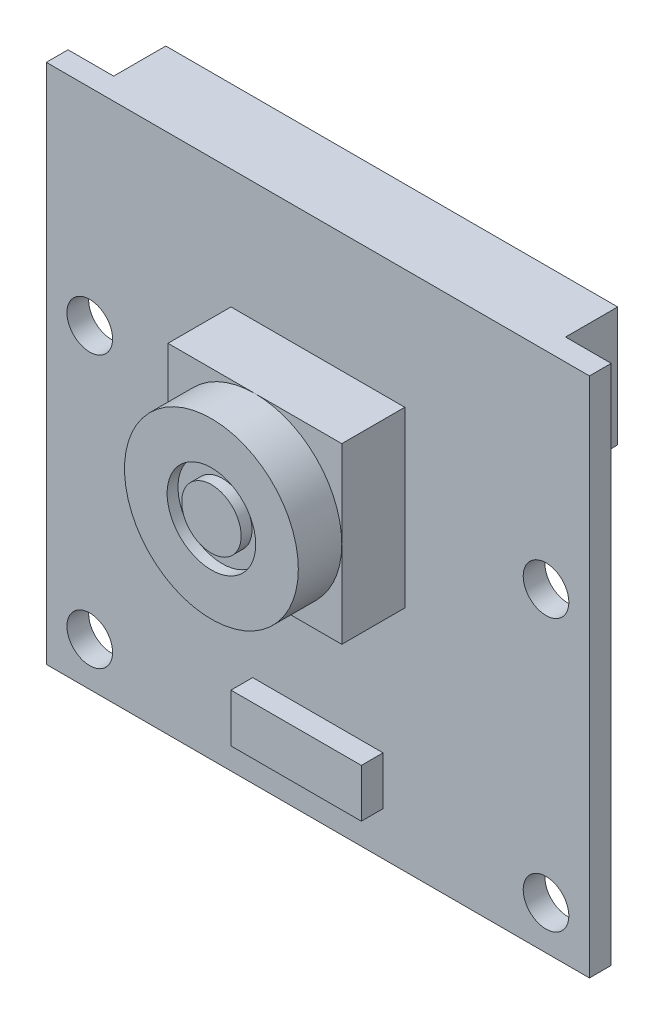
ISO-10303-21;
HEADER;
FILE_DESCRIPTION(('STEP AP214'),'2;1');
FILE_NAME('part.step','',(''),(''),'','','');
FILE_SCHEMA(('AUTOMOTIVE_DESIGN { 1 0 10303 214 1 1 1 1 }'));
ENDSEC;
DATA;
#1=APPLICATION_CONTEXT('core data for automotive mechanical design processes');
#2=APPLICATION_PROTOCOL_DEFINITION('international standard','automotive_design',2000,#1);
#3=PRODUCT_CONTEXT('',#1,'mechanical');
#4=PRODUCT('Part','Part','',(#3));
#5=PRODUCT_RELATED_PRODUCT_CATEGORY('part','',(#4));
#6=PRODUCT_DEFINITION_FORMATION('','',#4);
#7=PRODUCT_DEFINITION_CONTEXT('part definition',#1,'design');
#8=PRODUCT_DEFINITION('design','',#6,#7);
#9=PRODUCT_DEFINITION_SHAPE('','',#8);
#10=(LENGTH_UNIT() NAMED_UNIT(*) SI_UNIT(.MILLI.,.METRE.));
#11=(NAMED_UNIT(*) PLANE_ANGLE_UNIT() SI_UNIT($,.RADIAN.));
#12=(NAMED_UNIT(*) SI_UNIT($,.STERADIAN.) SOLID_ANGLE_UNIT());
#13=UNCERTAINTY_MEASURE_WITH_UNIT(LENGTH_MEASURE(1.E-05),#10,'distance_accuracy_value','');
#14=(GEOMETRIC_REPRESENTATION_CONTEXT(3) GLOBAL_UNCERTAINTY_ASSIGNED_CONTEXT((#13)) GLOBAL_UNIT_ASSIGNED_CONTEXT((#10,
#11,#12)) REPRESENTATION_CONTEXT('',''));
#15=CARTESIAN_POINT('',(0.,0.,0.));
#16=DIRECTION('',(0.,0.,1.));
#17=DIRECTION('',(1.,0.,0.));
#18=AXIS2_PLACEMENT_3D('',#15,#16,#17);
#19=CARTESIAN_POINT('',(0.,0.,1.));
#20=DIRECTION('',(0.,0.,1.));
#21=DIRECTION('',(1.,0.,0.));
#22=AXIS2_PLACEMENT_3D('',#19,#20,#21);
#23=PLANE('',#22);
#24=CARTESIAN_POINT('',(10.5,-10.,1.));
#25=DIRECTION('',(0.,0.,1.));
#26=DIRECTION('',(-1.,0.,0.));
#27=AXIS2_PLACEMENT_3D('',#24,#25,#26);
#28=CIRCLE('',#27,1.05);
#29=CARTESIAN_POINT('',(9.45,-10.,1.));
#30=VERTEX_POINT('',#29);
#31=EDGE_CURVE('E326',#30,#30,#28,.T.);
#32=ORIENTED_EDGE('',*,*,#31,.F.);
#33=EDGE_LOOP('',(#32));
#34=FACE_BOUND('',#33,.T.);
#35=CARTESIAN_POINT('',(-10.5,2.5,1.));
#36=DIRECTION('',(0.,0.,1.));
#37=DIRECTION('',(1.,0.,0.));
#38=AXIS2_PLACEMENT_3D('',#35,#36,#37);
#39=CIRCLE('',#38,1.05);
#40=CARTESIAN_POINT('',(-9.45,2.5,1.));
#41=VERTEX_POINT('',#40);
#42=EDGE_CURVE('E338',#41,#41,#39,.T.);
#43=ORIENTED_EDGE('',*,*,#42,.F.);
#44=EDGE_LOOP('',(#43));
#45=FACE_BOUND('',#44,.T.);
#46=DIRECTION('',(0.,1.,0.));
#47=VECTOR('',#46,1.);
#48=CARTESIAN_POINT('',(12.5,12.,1.));
#49=LINE('',#48,#47);
#50=CARTESIAN_POINT('',(12.5,-12.,1.));
#51=VERTEX_POINT('',#50);
#52=CARTESIAN_POINT('',(12.5,12.,1.));
#53=VERTEX_POINT('',#52);
#54=EDGE_CURVE('E344',#51,#53,#49,.T.);
#55=ORIENTED_EDGE('',*,*,#54,.T.);
#56=DIRECTION('',(-1.,0.,0.));
#57=VECTOR('',#56,1.);
#58=CARTESIAN_POINT('',(-12.5,12.,1.));
#59=LINE('',#58,#57);
#60=CARTESIAN_POINT('',(-12.5,12.,1.));
#61=VERTEX_POINT('',#60);
#62=EDGE_CURVE('E347',#53,#61,#59,.T.);
#63=ORIENTED_EDGE('',*,*,#62,.T.);
#64=DIRECTION('',(0.,-1.,0.));
#65=VECTOR('',#64,1.);
#66=CARTESIAN_POINT('',(-12.5,12.,1.));
#67=LINE('',#66,#65);
#68=CARTESIAN_POINT('',(-12.5,-12.,1.));
#69=VERTEX_POINT('',#68);
#70=EDGE_CURVE('E350',#61,#69,#67,.T.);
#71=ORIENTED_EDGE('',*,*,#70,.T.);
#72=DIRECTION('',(1.,0.,0.));
#73=VECTOR('',#72,1.);
#74=CARTESIAN_POINT('',(-12.5,-12.,1.));
#75=LINE('',#74,#73);
#76=EDGE_CURVE('E352',#69,#51,#75,.T.);
#77=ORIENTED_EDGE('',*,*,#76,.T.);
#78=EDGE_LOOP('',(#55,#63,#71,#77));
#79=FACE_BOUND('',#78,.T.);
#80=CARTESIAN_POINT('',(-10.5,-10.,1.));
#81=DIRECTION('',(0.,0.,1.));
#82=DIRECTION('',(1.,0.,0.));
#83=AXIS2_PLACEMENT_3D('',#80,#81,#82);
#84=CIRCLE('',#83,1.05);
#85=CARTESIAN_POINT('',(-9.45,-10.,1.));
#86=VERTEX_POINT('',#85);
#87=EDGE_CURVE('E332',#86,#86,#84,.T.);
#88=ORIENTED_EDGE('',*,*,#87,.F.);
#89=EDGE_LOOP('',(#88));
#90=FACE_BOUND('',#89,.T.);
#91=CARTESIAN_POINT('',(10.5,2.5,1.));
#92=DIRECTION('',(0.,0.,1.));
#93=DIRECTION('',(-1.,0.,0.));
#94=AXIS2_PLACEMENT_3D('',#91,#92,#93);
#95=CIRCLE('',#94,1.05);
#96=CARTESIAN_POINT('',(9.45,2.5,1.));
#97=VERTEX_POINT('',#96);
#98=EDGE_CURVE('E320',#97,#97,#95,.T.);
#99=ORIENTED_EDGE('',*,*,#98,.F.);
#100=EDGE_LOOP('',(#99));
#101=FACE_BOUND('',#100,.T.);
#102=DIRECTION('',(1.,0.,0.));
#103=VECTOR('',#102,1.);
#104=CARTESIAN_POINT('',(-3.99999999999999,-1.5,1.));
#105=LINE('',#104,#103);
#106=CARTESIAN_POINT('',(-3.99999999999999,-1.5,1.));
#107=VERTEX_POINT('',#106);
#108=CARTESIAN_POINT('',(4.00000000000001,-1.5,1.));
#109=VERTEX_POINT('',#108);
#110=EDGE_CURVE('E275',#107,#109,#105,.T.);
#111=ORIENTED_EDGE('',*,*,#110,.F.);
#112=DIRECTION('',(0.,-1.,0.));
#113=VECTOR('',#112,1.);
#114=CARTESIAN_POINT('',(-3.99999999999999,-1.5,1.));
#115=LINE('',#114,#113);
#116=CARTESIAN_POINT('',(-3.99999999999999,6.5,1.));
#117=VERTEX_POINT('',#116);
#118=EDGE_CURVE('E270',#117,#107,#115,.T.);
#119=ORIENTED_EDGE('',*,*,#118,.F.);
#120=DIRECTION('',(-1.,0.,0.));
#121=VECTOR('',#120,1.);
#122=CARTESIAN_POINT('',(-3.99999999999999,6.5,1.));
#123=LINE('',#122,#121);
#124=CARTESIAN_POINT('',(4.00000000000001,6.5,1.));
#125=VERTEX_POINT('',#124);
#126=EDGE_CURVE('E280',#125,#117,#123,.T.);
#127=ORIENTED_EDGE('',*,*,#126,.F.);
#128=DIRECTION('',(0.,1.,0.));
#129=VECTOR('',#128,1.);
#130=CARTESIAN_POINT('',(4.00000000000001,-1.5,1.));
#131=LINE('',#130,#129);
#132=EDGE_CURVE('E278',#109,#125,#131,.T.);
#133=ORIENTED_EDGE('',*,*,#132,.F.);
#134=EDGE_LOOP('',(#111,#119,#127,#133));
#135=FACE_BOUND('',#134,.T.);
#136=DIRECTION('',(1.,0.,0.));
#137=VECTOR('',#136,1.);
#138=CARTESIAN_POINT('',(-2.99999999999999,-10.,1.));
#139=LINE('',#138,#137);
#140=CARTESIAN_POINT('',(-2.99999999999999,-10.,1.));
#141=VERTEX_POINT('',#140);
#142=CARTESIAN_POINT('',(3.00000000000001,-10.,1.));
#143=VERTEX_POINT('',#142);
#144=EDGE_CURVE('E621',#141,#143,#139,.T.);
#145=ORIENTED_EDGE('',*,*,#144,.F.);
#146=DIRECTION('',(0.,-1.,0.));
#147=VECTOR('',#146,1.);
#148=CARTESIAN_POINT('',(-2.99999999999999,-10.,1.));
#149=LINE('',#148,#147);
#150=CARTESIAN_POINT('',(-2.99999999999999,-7.77539273210694,1.));
#151=VERTEX_POINT('',#150);
#152=EDGE_CURVE('E222',#151,#141,#149,.T.);
#153=ORIENTED_EDGE('',*,*,#152,.F.);
#154=DIRECTION('',(-1.,0.,0.));
#155=VECTOR('',#154,1.);
#156=CARTESIAN_POINT('',(-2.99999999999999,-7.77539273210694,1.));
#157=LINE('',#156,#155);
#158=CARTESIAN_POINT('',(3.00000000000001,-7.77539273210694,1.));
#159=VERTEX_POINT('',#158);
#160=EDGE_CURVE('E218',#159,#151,#157,.T.);
#161=ORIENTED_EDGE('',*,*,#160,.F.);
#162=DIRECTION('',(0.,1.,0.));
#163=VECTOR('',#162,1.);
#164=CARTESIAN_POINT('',(3.00000000000001,-10.,1.));
#165=LINE('',#164,#163);
#166=EDGE_CURVE('E623',#143,#159,#165,.T.);
#167=ORIENTED_EDGE('',*,*,#166,.F.);
#168=EDGE_LOOP('',(#145,#153,#161,#167));
#169=FACE_BOUND('',#168,.T.);
#170=ADVANCED_FACE('F72',(#34,#45,#79,#90,#101,#135,#169),#23,.T.);
#171=CARTESIAN_POINT('',(0.,0.,5.9));
#172=DIRECTION('',(0.,0.,-1.));
#173=DIRECTION('',(-1.,0.,0.));
#174=AXIS2_PLACEMENT_3D('',#171,#172,#173);
#175=PLANE('',#174);
#176=CARTESIAN_POINT('',(0.,2.5,5.9));
#177=DIRECTION('',(0.,0.,1.));
#178=DIRECTION('',(1.,0.,0.));
#179=AXIS2_PLACEMENT_3D('',#176,#177,#178);
#180=CIRCLE('',#179,2.03819798857282);
#181=CARTESIAN_POINT('',(2.03819798857282,2.5,5.9));
#182=VERTEX_POINT('',#181);
#183=EDGE_CURVE('E233',#182,#182,#180,.T.);
#184=ORIENTED_EDGE('',*,*,#183,.F.);
#185=EDGE_LOOP('',(#184));
#186=FACE_BOUND('',#185,.T.);
#187=CARTESIAN_POINT('',(0.,2.5,5.9));
#188=DIRECTION('',(0.,0.,1.));
#189=DIRECTION('',(1.,0.,0.));
#190=AXIS2_PLACEMENT_3D('',#187,#188,#189);
#191=CIRCLE('',#190,4.);
#192=CARTESIAN_POINT('',(4.,2.5,5.9));
#193=VERTEX_POINT('',#192);
#194=EDGE_CURVE('E261',#193,#193,#191,.T.);
#195=ORIENTED_EDGE('',*,*,#194,.T.);
#196=EDGE_LOOP('',(#195));
#197=FACE_BOUND('',#196,.T.);
#198=ADVANCED_FACE('F415',(#186,#197),#175,.F.);
#199=CARTESIAN_POINT('',(-3.99999999999999,-1.5,5.9));
#200=DIRECTION('',(1.,0.,0.));
#201=DIRECTION('',(0.,0.,-1.));
#202=AXIS2_PLACEMENT_3D('',#199,#200,#201);
#203=PLANE('',#202);
#204=DIRECTION('',(0.,-1.,0.));
#205=VECTOR('',#204,1.);
#206=CARTESIAN_POINT('',(-3.99999999999999,0.,3.9));
#207=LINE('',#206,#205);
#208=CARTESIAN_POINT('',(-3.99999999999999,2.5,3.9));
#209=VERTEX_POINT('',#208);
#210=CARTESIAN_POINT('',(-3.99999999999999,-1.5,3.9));
#211=VERTEX_POINT('',#210);
#212=EDGE_CURVE('E243',#209,#211,#207,.T.);
#213=ORIENTED_EDGE('',*,*,#212,.F.);
#214=DIRECTION('',(0.,-1.,0.));
#215=VECTOR('',#214,1.);
#216=CARTESIAN_POINT('',(-3.99999999999999,0.,3.9));
#217=LINE('',#216,#215);
#218=CARTESIAN_POINT('',(-3.99999999999999,6.5,3.9));
#219=VERTEX_POINT('',#218);
#220=EDGE_CURVE('E267',#219,#209,#217,.T.);
#221=ORIENTED_EDGE('',*,*,#220,.F.);
#222=DIRECTION('',(0.,0.,-1.));
#223=VECTOR('',#222,1.);
#224=CARTESIAN_POINT('',(-3.99999999999999,6.5,5.9));
#225=LINE('',#224,#223);
#226=EDGE_CURVE('E282',#219,#117,#225,.T.);
#227=ORIENTED_EDGE('',*,*,#226,.T.);
#228=ORIENTED_EDGE('',*,*,#118,.T.);
#229=DIRECTION('',(0.,0.,-1.));
#230=VECTOR('',#229,1.);
#231=CARTESIAN_POINT('',(-3.99999999999999,-1.5,5.9));
#232=LINE('',#231,#230);
#233=EDGE_CURVE('E287',#211,#107,#232,.T.);
#234=ORIENTED_EDGE('',*,*,#233,.F.);
#235=EDGE_LOOP('',(#213,#221,#227,#228,#234));
#236=FACE_BOUND('',#235,.T.);
#237=ADVANCED_FACE('F421',(#236),#203,.F.);
#238=CARTESIAN_POINT('',(-3.99999999999999,-1.5,5.9));
#239=DIRECTION('',(0.,1.,0.));
#240=DIRECTION('',(0.,0.,1.));
#241=AXIS2_PLACEMENT_3D('',#238,#239,#240);
#242=PLANE('',#241);
#243=DIRECTION('',(1.,0.,0.));
#244=VECTOR('',#243,1.);
#245=CARTESIAN_POINT('',(0.,-1.5,3.9));
#246=LINE('',#245,#244);
#247=CARTESIAN_POINT('',(0.,-1.5,3.9));
#248=VERTEX_POINT('',#247);
#249=EDGE_CURVE('E238',#211,#248,#246,.T.);
#250=ORIENTED_EDGE('',*,*,#249,.F.);
#251=ORIENTED_EDGE('',*,*,#233,.T.);
#252=ORIENTED_EDGE('',*,*,#110,.T.);
#253=DIRECTION('',(0.,0.,-1.));
#254=VECTOR('',#253,1.);
#255=CARTESIAN_POINT('',(4.00000000000001,-1.5,5.9));
#256=LINE('',#255,#254);
#257=CARTESIAN_POINT('',(4.00000000000001,-1.5,3.9));
#258=VERTEX_POINT('',#257);
#259=EDGE_CURVE('E285',#258,#109,#256,.T.);
#260=ORIENTED_EDGE('',*,*,#259,.F.);
#261=DIRECTION('',(1.,0.,0.));
#262=VECTOR('',#261,1.);
#263=CARTESIAN_POINT('',(0.,-1.5,3.9));
#264=LINE('',#263,#262);
#265=EDGE_CURVE('E250',#248,#258,#264,.T.);
#266=ORIENTED_EDGE('',*,*,#265,.F.);
#267=EDGE_LOOP('',(#250,#251,#252,#260,#266));
#268=FACE_BOUND('',#267,.T.);
#269=ADVANCED_FACE('F464',(#268),#242,.F.);
#270=CARTESIAN_POINT('',(4.00000000000001,-1.5,5.9));
#271=DIRECTION('',(-1.,0.,0.));
#272=DIRECTION('',(0.,0.,1.));
#273=AXIS2_PLACEMENT_3D('',#270,#271,#272);
#274=PLANE('',#273);
#275=DIRECTION('',(0.,1.,0.));
#276=VECTOR('',#275,1.);
#277=CARTESIAN_POINT('',(4.00000000000001,0.,3.9));
#278=LINE('',#277,#276);
#279=CARTESIAN_POINT('',(4.00000000000001,2.5,3.9));
#280=VERTEX_POINT('',#279);
#281=EDGE_CURVE('E252',#258,#280,#278,.T.);
#282=ORIENTED_EDGE('',*,*,#281,.F.);
#283=ORIENTED_EDGE('',*,*,#259,.T.);
#284=ORIENTED_EDGE('',*,*,#132,.T.);
#285=DIRECTION('',(0.,0.,-1.));
#286=VECTOR('',#285,1.);
#287=CARTESIAN_POINT('',(4.00000000000001,6.5,5.9));
#288=LINE('',#287,#286);
#289=CARTESIAN_POINT('',(4.00000000000001,6.5,3.9));
#290=VERTEX_POINT('',#289);
#291=EDGE_CURVE('E95',#290,#125,#288,.T.);
#292=ORIENTED_EDGE('',*,*,#291,.F.);
#293=DIRECTION('',(0.,1.,0.));
#294=VECTOR('',#293,1.);
#295=CARTESIAN_POINT('',(4.00000000000001,0.,3.9));
#296=LINE('',#295,#294);
#297=EDGE_CURVE('E256',#280,#290,#296,.T.);
#298=ORIENTED_EDGE('',*,*,#297,.F.);
#299=EDGE_LOOP('',(#282,#283,#284,#292,#298));
#300=FACE_BOUND('',#299,.T.);
#301=ADVANCED_FACE('F456',(#300),#274,.F.);
#302=CARTESIAN_POINT('',(-3.99999999999999,6.5,5.9));
#303=DIRECTION('',(0.,-1.,0.));
#304=DIRECTION('',(0.,0.,-1.));
#305=AXIS2_PLACEMENT_3D('',#302,#303,#304);
#306=PLANE('',#305);
#307=DIRECTION('',(-1.,0.,0.));
#308=VECTOR('',#307,1.);
#309=CARTESIAN_POINT('',(0.,6.5,3.9));
#310=LINE('',#309,#308);
#311=CARTESIAN_POINT('',(0.,6.5,3.9));
#312=VERTEX_POINT('',#311);
#313=EDGE_CURVE('E254',#290,#312,#310,.T.);
#314=ORIENTED_EDGE('',*,*,#313,.F.);
#315=ORIENTED_EDGE('',*,*,#291,.T.);
#316=ORIENTED_EDGE('',*,*,#126,.T.);
#317=ORIENTED_EDGE('',*,*,#226,.F.);
#318=DIRECTION('',(-1.,0.,0.));
#319=VECTOR('',#318,1.);
#320=CARTESIAN_POINT('',(0.,6.5,3.9));
#321=LINE('',#320,#319);
#322=EDGE_CURVE('E265',#312,#219,#321,.T.);
#323=ORIENTED_EDGE('',*,*,#322,.F.);
#324=EDGE_LOOP('',(#314,#315,#316,#317,#323));
#325=FACE_BOUND('',#324,.T.);
#326=ADVANCED_FACE('F433',(#325),#306,.F.);
#327=CARTESIAN_POINT('',(0.,0.,0.));
#328=DIRECTION('',(0.,0.,1.));
#329=DIRECTION('',(1.,0.,0.));
#330=AXIS2_PLACEMENT_3D('',#327,#328,#329);
#331=PLANE('',#330);
#332=CARTESIAN_POINT('',(10.5,2.5,0.));
#333=DIRECTION('',(0.,0.,1.));
#334=DIRECTION('',(-1.,0.,0.));
#335=AXIS2_PLACEMENT_3D('',#332,#333,#334);
#336=CIRCLE('',#335,1.05);
#337=CARTESIAN_POINT('',(9.45,2.5,0.));
#338=VERTEX_POINT('',#337);
#339=EDGE_CURVE('E319',#338,#338,#336,.T.);
#340=ORIENTED_EDGE('',*,*,#339,.T.);
#341=EDGE_LOOP('',(#340));
#342=FACE_BOUND('',#341,.T.);
#343=CARTESIAN_POINT('',(10.5,-10.,0.));
#344=DIRECTION('',(0.,0.,1.));
#345=DIRECTION('',(-1.,0.,0.));
#346=AXIS2_PLACEMENT_3D('',#343,#344,#345);
#347=CIRCLE('',#346,1.05);
#348=CARTESIAN_POINT('',(9.45,-10.,0.));
#349=VERTEX_POINT('',#348);
#350=EDGE_CURVE('E323',#349,#349,#347,.T.);
#351=ORIENTED_EDGE('',*,*,#350,.T.);
#352=EDGE_LOOP('',(#351));
#353=FACE_BOUND('',#352,.T.);
#354=CARTESIAN_POINT('',(-10.5,-10.,0.));
#355=DIRECTION('',(0.,0.,1.));
#356=DIRECTION('',(1.,0.,0.));
#357=AXIS2_PLACEMENT_3D('',#354,#355,#356);
#358=CIRCLE('',#357,1.05);
#359=CARTESIAN_POINT('',(-9.45,-10.,0.));
#360=VERTEX_POINT('',#359);
#361=EDGE_CURVE('E329',#360,#360,#358,.T.);
#362=ORIENTED_EDGE('',*,*,#361,.T.);
#363=EDGE_LOOP('',(#362));
#364=FACE_BOUND('',#363,.T.);
#365=CARTESIAN_POINT('',(-10.5,2.5,0.));
#366=DIRECTION('',(0.,0.,1.));
#367=DIRECTION('',(1.,0.,0.));
#368=AXIS2_PLACEMENT_3D('',#365,#366,#367);
#369=CIRCLE('',#368,1.05);
#370=CARTESIAN_POINT('',(-9.45,2.5,0.));
#371=VERTEX_POINT('',#370);
#372=EDGE_CURVE('E335',#371,#371,#369,.T.);
#373=ORIENTED_EDGE('',*,*,#372,.T.);
#374=EDGE_LOOP('',(#373));
#375=FACE_BOUND('',#374,.T.);
#376=DIRECTION('',(0.,1.,0.));
#377=VECTOR('',#376,1.);
#378=CARTESIAN_POINT('',(-10.4,12.,0.));
#379=LINE('',#378,#377);
#380=CARTESIAN_POINT('',(-10.4,6.5,0.));
#381=VERTEX_POINT('',#380);
#382=CARTESIAN_POINT('',(-10.4,12.,0.));
#383=VERTEX_POINT('',#382);
#384=EDGE_CURVE('E289',#381,#383,#379,.T.);
#385=ORIENTED_EDGE('',*,*,#384,.F.);
#386=DIRECTION('',(-1.,0.,0.));
#387=VECTOR('',#386,1.);
#388=CARTESIAN_POINT('',(-10.4,6.5,0.));
#389=LINE('',#388,#387);
#390=CARTESIAN_POINT('',(10.4,6.5,0.));
#391=VERTEX_POINT('',#390);
#392=EDGE_CURVE('E294',#391,#381,#389,.T.);
#393=ORIENTED_EDGE('',*,*,#392,.F.);
#394=DIRECTION('',(0.,-1.,0.));
#395=VECTOR('',#394,1.);
#396=CARTESIAN_POINT('',(10.4,12.,0.));
#397=LINE('',#396,#395);
#398=CARTESIAN_POINT('',(10.4,12.,0.));
#399=VERTEX_POINT('',#398);
#400=EDGE_CURVE('E303',#399,#391,#397,.T.);
#401=ORIENTED_EDGE('',*,*,#400,.F.);
#402=DIRECTION('',(-1.,0.,0.));
#403=VECTOR('',#402,1.);
#404=CARTESIAN_POINT('',(-12.5,12.,0.));
#405=LINE('',#404,#403);
#406=CARTESIAN_POINT('',(12.5,12.,0.));
#407=VERTEX_POINT('',#406);
#408=EDGE_CURVE('E358',#407,#399,#405,.T.);
#409=ORIENTED_EDGE('',*,*,#408,.F.);
#410=DIRECTION('',(0.,1.,0.));
#411=VECTOR('',#410,1.);
#412=CARTESIAN_POINT('',(12.5,12.,0.));
#413=LINE('',#412,#411);
#414=CARTESIAN_POINT('',(12.5,-12.,0.));
#415=VERTEX_POINT('',#414);
#416=EDGE_CURVE('E341',#415,#407,#413,.T.);
#417=ORIENTED_EDGE('',*,*,#416,.F.);
#418=DIRECTION('',(1.,0.,0.));
#419=VECTOR('',#418,1.);
#420=CARTESIAN_POINT('',(-12.5,-12.,0.));
#421=LINE('',#420,#419);
#422=CARTESIAN_POINT('',(-12.5,-12.,0.));
#423=VERTEX_POINT('',#422);
#424=EDGE_CURVE('E348',#423,#415,#421,.T.);
#425=ORIENTED_EDGE('',*,*,#424,.F.);
#426=DIRECTION('',(0.,-1.,0.));
#427=VECTOR('',#426,1.);
#428=CARTESIAN_POINT('',(-12.5,12.,0.));
#429=LINE('',#428,#427);
#430=CARTESIAN_POINT('',(-12.5,12.,0.));
#431=VERTEX_POINT('',#430);
#432=EDGE_CURVE('E361',#431,#423,#429,.T.);
#433=ORIENTED_EDGE('',*,*,#432,.F.);
#434=EDGE_CURVE('E357',#383,#431,#405,.T.);
#435=ORIENTED_EDGE('',*,*,#434,.F.);
#436=EDGE_LOOP('',(#385,#393,#401,#409,#417,#425,#433,#435));
#437=FACE_BOUND('',#436,.T.);
#438=ADVANCED_FACE('F378',(#342,#353,#364,#375,#437),#331,.F.);
#439=CARTESIAN_POINT('',(12.5,12.,1.));
#440=DIRECTION('',(-1.,0.,0.));
#441=DIRECTION('',(0.,-1.,0.));
#442=AXIS2_PLACEMENT_3D('',#439,#440,#441);
#443=PLANE('',#442);
#444=ORIENTED_EDGE('',*,*,#416,.T.);
#445=DIRECTION('',(0.,0.,-1.));
#446=VECTOR('',#445,1.);
#447=CARTESIAN_POINT('',(12.5,12.,1.));
#448=LINE('',#447,#446);
#449=EDGE_CURVE('E12',#53,#407,#448,.T.);
#450=ORIENTED_EDGE('',*,*,#449,.F.);
#451=ORIENTED_EDGE('',*,*,#54,.F.);
#452=DIRECTION('',(0.,0.,-1.));
#453=VECTOR('',#452,1.);
#454=CARTESIAN_POINT('',(12.5,-12.,1.));
#455=LINE('',#454,#453);
#456=EDGE_CURVE('E354',#51,#415,#455,.T.);
#457=ORIENTED_EDGE('',*,*,#456,.T.);
#458=EDGE_LOOP('',(#444,#450,#451,#457));
#459=FACE_BOUND('',#458,.T.);
#460=ADVANCED_FACE('F74',(#459),#443,.F.);
#461=CARTESIAN_POINT('',(-12.5,12.,1.));
#462=DIRECTION('',(0.,-1.,0.));
#463=DIRECTION('',(0.,0.,-1.));
#464=AXIS2_PLACEMENT_3D('',#461,#462,#463);
#465=PLANE('',#464);
#466=ORIENTED_EDGE('',*,*,#408,.T.);
#467=DIRECTION('',(0.,0.,1.));
#468=VECTOR('',#467,1.);
#469=CARTESIAN_POINT('',(10.4,12.,-2.4));
#470=LINE('',#469,#468);
#471=CARTESIAN_POINT('',(10.4,12.,-2.4));
#472=VERTEX_POINT('',#471);
#473=EDGE_CURVE('E313',#472,#399,#470,.T.);
#474=ORIENTED_EDGE('',*,*,#473,.F.);
#475=DIRECTION('',(1.,0.,0.));
#476=VECTOR('',#475,1.);
#477=CARTESIAN_POINT('',(-10.4,12.,-2.4));
#478=LINE('',#477,#476);
#479=CARTESIAN_POINT('',(-10.4,12.,-2.4));
#480=VERTEX_POINT('',#479);
#481=EDGE_CURVE('E293',#480,#472,#478,.T.);
#482=ORIENTED_EDGE('',*,*,#481,.F.);
#483=DIRECTION('',(0.,0.,1.));
#484=VECTOR('',#483,1.);
#485=CARTESIAN_POINT('',(-10.4,12.,-2.4));
#486=LINE('',#485,#484);
#487=EDGE_CURVE('E316',#480,#383,#486,.T.);
#488=ORIENTED_EDGE('',*,*,#487,.T.);
#489=ORIENTED_EDGE('',*,*,#434,.T.);
#490=DIRECTION('',(0.,0.,-1.));
#491=VECTOR('',#490,1.);
#492=CARTESIAN_POINT('',(-12.5,12.,1.));
#493=LINE('',#492,#491);
#494=EDGE_CURVE('E80',#61,#431,#493,.T.);
#495=ORIENTED_EDGE('',*,*,#494,.F.);
#496=ORIENTED_EDGE('',*,*,#62,.F.);
#497=ORIENTED_EDGE('',*,*,#449,.T.);
#498=EDGE_LOOP('',(#466,#474,#482,#488,#489,#495,#496,#497));
#499=FACE_BOUND('',#498,.T.);
#500=ADVANCED_FACE('F389',(#499),#465,.F.);
#501=CARTESIAN_POINT('',(-12.5,12.,1.));
#502=DIRECTION('',(1.,0.,0.));
#503=DIRECTION('',(0.,1.,0.));
#504=AXIS2_PLACEMENT_3D('',#501,#502,#503);
#505=PLANE('',#504);
#506=ORIENTED_EDGE('',*,*,#432,.T.);
#507=DIRECTION('',(0.,0.,-1.));
#508=VECTOR('',#507,1.);
#509=CARTESIAN_POINT('',(-12.5,-12.,1.));
#510=LINE('',#509,#508);
#511=EDGE_CURVE('E366',#69,#423,#510,.T.);
#512=ORIENTED_EDGE('',*,*,#511,.F.);
#513=ORIENTED_EDGE('',*,*,#70,.F.);
#514=ORIENTED_EDGE('',*,*,#494,.T.);
#515=EDGE_LOOP('',(#506,#512,#513,#514));
#516=FACE_BOUND('',#515,.T.);
#517=ADVANCED_FACE('F373',(#516),#505,.F.);
#518=CARTESIAN_POINT('',(-12.5,-12.,1.));
#519=DIRECTION('',(0.,1.,0.));
#520=DIRECTION('',(0.,0.,1.));
#521=AXIS2_PLACEMENT_3D('',#518,#519,#520);
#522=PLANE('',#521);
#523=ORIENTED_EDGE('',*,*,#424,.T.);
#524=ORIENTED_EDGE('',*,*,#456,.F.);
#525=ORIENTED_EDGE('',*,*,#76,.F.);
#526=ORIENTED_EDGE('',*,*,#511,.T.);
#527=EDGE_LOOP('',(#523,#524,#525,#526));
#528=FACE_BOUND('',#527,.T.);
#529=ADVANCED_FACE('F382',(#528),#522,.F.);
#530=CARTESIAN_POINT('',(-10.5,2.5,1.));
#531=DIRECTION('',(0.,0.,-1.));
#532=DIRECTION('',(-1.,0.,0.));
#533=AXIS2_PLACEMENT_3D('',#530,#531,#532);
#534=CYLINDRICAL_SURFACE('',#533,1.05);
#535=ORIENTED_EDGE('',*,*,#42,.T.);
#536=EDGE_LOOP('',(#535));
#537=FACE_BOUND('',#536,.T.);
#538=ORIENTED_EDGE('',*,*,#372,.F.);
#539=EDGE_LOOP('',(#538));
#540=FACE_BOUND('',#539,.T.);
#541=ADVANCED_FACE('F429',(#537,#540),#534,.F.);
#542=CARTESIAN_POINT('',(-10.5,-10.,1.));
#543=DIRECTION('',(0.,0.,-1.));
#544=DIRECTION('',(-1.,0.,0.));
#545=AXIS2_PLACEMENT_3D('',#542,#543,#544);
#546=CYLINDRICAL_SURFACE('',#545,1.05);
#547=ORIENTED_EDGE('',*,*,#87,.T.);
#548=EDGE_LOOP('',(#547));
#549=FACE_BOUND('',#548,.T.);
#550=ORIENTED_EDGE('',*,*,#361,.F.);
#551=EDGE_LOOP('',(#550));
#552=FACE_BOUND('',#551,.T.);
#553=ADVANCED_FACE('F713',(#549,#552),#546,.F.);
#554=CARTESIAN_POINT('',(10.5,-10.,1.));
#555=DIRECTION('',(0.,0.,-1.));
#556=DIRECTION('',(-1.,0.,0.));
#557=AXIS2_PLACEMENT_3D('',#554,#555,#556);
#558=CYLINDRICAL_SURFACE('',#557,1.05);
#559=ORIENTED_EDGE('',*,*,#31,.T.);
#560=EDGE_LOOP('',(#559));
#561=FACE_BOUND('',#560,.T.);
#562=ORIENTED_EDGE('',*,*,#350,.F.);
#563=EDGE_LOOP('',(#562));
#564=FACE_BOUND('',#563,.T.);
#565=ADVANCED_FACE('F704',(#561,#564),#558,.F.);
#566=CARTESIAN_POINT('',(10.5,2.5,1.));
#567=DIRECTION('',(0.,0.,-1.));
#568=DIRECTION('',(-1.,0.,0.));
#569=AXIS2_PLACEMENT_3D('',#566,#567,#568);
#570=CYLINDRICAL_SURFACE('',#569,1.05);
#571=ORIENTED_EDGE('',*,*,#98,.T.);
#572=EDGE_LOOP('',(#571));
#573=FACE_BOUND('',#572,.T.);
#574=ORIENTED_EDGE('',*,*,#339,.F.);
#575=EDGE_LOOP('',(#574));
#576=FACE_BOUND('',#575,.T.);
#577=ADVANCED_FACE('F684',(#573,#576),#570,.F.);
#578=CARTESIAN_POINT('',(-10.4,12.,-2.4));
#579=DIRECTION('',(1.,0.,0.));
#580=DIRECTION('',(0.,0.,-1.));
#581=AXIS2_PLACEMENT_3D('',#578,#579,#580);
#582=PLANE('',#581);
#583=ORIENTED_EDGE('',*,*,#384,.T.);
#584=ORIENTED_EDGE('',*,*,#487,.F.);
#585=DIRECTION('',(0.,1.,0.));
#586=VECTOR('',#585,1.);
#587=CARTESIAN_POINT('',(-10.4,12.,-2.4));
#588=LINE('',#587,#586);
#589=CARTESIAN_POINT('',(-10.4,6.5,-2.4));
#590=VERTEX_POINT('',#589);
#591=EDGE_CURVE('E290',#590,#480,#588,.T.);
#592=ORIENTED_EDGE('',*,*,#591,.F.);
#593=DIRECTION('',(0.,0.,1.));
#594=VECTOR('',#593,1.);
#595=CARTESIAN_POINT('',(-10.4,6.5,-2.4));
#596=LINE('',#595,#594);
#597=EDGE_CURVE('E300',#590,#381,#596,.T.);
#598=ORIENTED_EDGE('',*,*,#597,.T.);
#599=EDGE_LOOP('',(#583,#584,#592,#598));
#600=FACE_BOUND('',#599,.T.);
#601=ADVANCED_FACE('F402',(#600),#582,.F.);
#602=CARTESIAN_POINT('',(10.4,12.,-2.4));
#603=DIRECTION('',(-1.,0.,0.));
#604=DIRECTION('',(0.,-1.,0.));
#605=AXIS2_PLACEMENT_3D('',#602,#603,#604);
#606=PLANE('',#605);
#607=ORIENTED_EDGE('',*,*,#400,.T.);
#608=DIRECTION('',(0.,0.,1.));
#609=VECTOR('',#608,1.);
#610=CARTESIAN_POINT('',(10.4,6.5,-2.4));
#611=LINE('',#610,#609);
#612=CARTESIAN_POINT('',(10.4,6.5,-2.4));
#613=VERTEX_POINT('',#612);
#614=EDGE_CURVE('E310',#613,#391,#611,.T.);
#615=ORIENTED_EDGE('',*,*,#614,.F.);
#616=DIRECTION('',(0.,-1.,0.));
#617=VECTOR('',#616,1.);
#618=CARTESIAN_POINT('',(10.4,12.,-2.4));
#619=LINE('',#618,#617);
#620=EDGE_CURVE('E296',#472,#613,#619,.T.);
#621=ORIENTED_EDGE('',*,*,#620,.F.);
#622=ORIENTED_EDGE('',*,*,#473,.T.);
#623=EDGE_LOOP('',(#607,#615,#621,#622));
#624=FACE_BOUND('',#623,.T.);
#625=ADVANCED_FACE('F393',(#624),#606,.F.);
#626=CARTESIAN_POINT('',(-10.4,6.5,-2.4));
#627=DIRECTION('',(0.,1.,0.));
#628=DIRECTION('',(-1.,0.,0.));
#629=AXIS2_PLACEMENT_3D('',#626,#627,#628);
#630=PLANE('',#629);
#631=ORIENTED_EDGE('',*,*,#392,.T.);
#632=ORIENTED_EDGE('',*,*,#597,.F.);
#633=DIRECTION('',(-1.,0.,0.));
#634=VECTOR('',#633,1.);
#635=CARTESIAN_POINT('',(-10.4,6.5,-2.4));
#636=LINE('',#635,#634);
#637=EDGE_CURVE('E298',#613,#590,#636,.T.);
#638=ORIENTED_EDGE('',*,*,#637,.F.);
#639=ORIENTED_EDGE('',*,*,#614,.T.);
#640=EDGE_LOOP('',(#631,#632,#638,#639));
#641=FACE_BOUND('',#640,.T.);
#642=ADVANCED_FACE('F404',(#641),#630,.F.);
#643=CARTESIAN_POINT('',(0.,0.,-2.4));
#644=DIRECTION('',(0.,0.,1.));
#645=DIRECTION('',(1.,0.,0.));
#646=AXIS2_PLACEMENT_3D('',#643,#644,#645);
#647=PLANE('',#646);
#648=ORIENTED_EDGE('',*,*,#591,.T.);
#649=ORIENTED_EDGE('',*,*,#481,.T.);
#650=ORIENTED_EDGE('',*,*,#620,.T.);
#651=ORIENTED_EDGE('',*,*,#637,.T.);
#652=EDGE_LOOP('',(#648,#649,#650,#651));
#653=FACE_BOUND('',#652,.T.);
#654=ADVANCED_FACE('F397',(#653),#647,.F.);
#655=CARTESIAN_POINT('',(0.,2.5,3.9));
#656=DIRECTION('',(0.,0.,1.));
#657=DIRECTION('',(1.,0.,0.));
#658=AXIS2_PLACEMENT_3D('',#655,#656,#657);
#659=CYLINDRICAL_SURFACE('',#658,4.);
#660=ORIENTED_EDGE('',*,*,#194,.F.);
#661=EDGE_LOOP('',(#660));
#662=FACE_BOUND('',#661,.T.);
#663=CARTESIAN_POINT('',(0.,2.5,3.9));
#664=DIRECTION('',(0.,0.,1.));
#665=DIRECTION('',(1.,0.,0.));
#666=AXIS2_PLACEMENT_3D('',#663,#664,#665);
#667=CIRCLE('',#666,4.);
#668=EDGE_CURVE('E245',#209,#248,#667,.T.);
#669=ORIENTED_EDGE('',*,*,#668,.T.);
#670=CARTESIAN_POINT('',(0.,2.5,3.9));
#671=DIRECTION('',(0.,0.,1.));
#672=DIRECTION('',(1.,0.,0.));
#673=AXIS2_PLACEMENT_3D('',#670,#671,#672);
#674=CIRCLE('',#673,4.);
#675=EDGE_CURVE('E247',#248,#280,#674,.T.);
#676=ORIENTED_EDGE('',*,*,#675,.T.);
#677=CARTESIAN_POINT('',(0.,2.5,3.9));
#678=DIRECTION('',(0.,0.,1.));
#679=DIRECTION('',(1.,0.,0.));
#680=AXIS2_PLACEMENT_3D('',#677,#678,#679);
#681=CIRCLE('',#680,4.);
#682=EDGE_CURVE('E258',#280,#312,#681,.T.);
#683=ORIENTED_EDGE('',*,*,#682,.T.);
#684=CARTESIAN_POINT('',(0.,2.5,3.9));
#685=DIRECTION('',(0.,0.,1.));
#686=DIRECTION('',(1.,0.,0.));
#687=AXIS2_PLACEMENT_3D('',#684,#685,#686);
#688=CIRCLE('',#687,4.);
#689=EDGE_CURVE('E262',#312,#209,#688,.T.);
#690=ORIENTED_EDGE('',*,*,#689,.T.);
#691=EDGE_LOOP('',(#669,#676,#683,#690));
#692=FACE_BOUND('',#691,.T.);
#693=ADVANCED_FACE('F411',(#662,#692),#659,.T.);
#694=CARTESIAN_POINT('',(0.,0.,3.9));
#695=DIRECTION('',(0.,0.,1.));
#696=DIRECTION('',(1.,0.,0.));
#697=AXIS2_PLACEMENT_3D('',#694,#695,#696);
#698=PLANE('',#697);
#699=ORIENTED_EDGE('',*,*,#689,.F.);
#700=ORIENTED_EDGE('',*,*,#322,.T.);
#701=ORIENTED_EDGE('',*,*,#220,.T.);
#702=EDGE_LOOP('',(#699,#700,#701));
#703=FACE_BOUND('',#702,.T.);
#704=ADVANCED_FACE('F591',(#703),#698,.T.);
#705=CARTESIAN_POINT('',(0.,0.,3.9));
#706=DIRECTION('',(0.,0.,1.));
#707=DIRECTION('',(1.,0.,0.));
#708=AXIS2_PLACEMENT_3D('',#705,#706,#707);
#709=PLANE('',#708);
#710=ORIENTED_EDGE('',*,*,#682,.F.);
#711=ORIENTED_EDGE('',*,*,#297,.T.);
#712=ORIENTED_EDGE('',*,*,#313,.T.);
#713=EDGE_LOOP('',(#710,#711,#712));
#714=FACE_BOUND('',#713,.T.);
#715=ADVANCED_FACE('F587',(#714),#709,.T.);
#716=CARTESIAN_POINT('',(0.,0.,3.9));
#717=DIRECTION('',(0.,0.,1.));
#718=DIRECTION('',(1.,0.,0.));
#719=AXIS2_PLACEMENT_3D('',#716,#717,#718);
#720=PLANE('',#719);
#721=ORIENTED_EDGE('',*,*,#675,.F.);
#722=ORIENTED_EDGE('',*,*,#265,.T.);
#723=ORIENTED_EDGE('',*,*,#281,.T.);
#724=EDGE_LOOP('',(#721,#722,#723));
#725=FACE_BOUND('',#724,.T.);
#726=ADVANCED_FACE('F583',(#725),#720,.T.);
#727=CARTESIAN_POINT('',(0.,0.,3.9));
#728=DIRECTION('',(0.,0.,1.));
#729=DIRECTION('',(1.,0.,0.));
#730=AXIS2_PLACEMENT_3D('',#727,#728,#729);
#731=PLANE('',#730);
#732=ORIENTED_EDGE('',*,*,#668,.F.);
#733=ORIENTED_EDGE('',*,*,#212,.T.);
#734=ORIENTED_EDGE('',*,*,#249,.T.);
#735=EDGE_LOOP('',(#732,#733,#734));
#736=FACE_BOUND('',#735,.T.);
#737=ADVANCED_FACE('F492',(#736),#731,.T.);
#738=CARTESIAN_POINT('',(0.,2.5,5.4));
#739=DIRECTION('',(0.,0.,1.));
#740=DIRECTION('',(1.,0.,0.));
#741=AXIS2_PLACEMENT_3D('',#738,#739,#740);
#742=CYLINDRICAL_SURFACE('',#741,2.03819798857282);
#743=CARTESIAN_POINT('',(0.,2.5,5.4));
#744=DIRECTION('',(0.,0.,1.));
#745=DIRECTION('',(1.,0.,0.));
#746=AXIS2_PLACEMENT_3D('',#743,#744,#745);
#747=CIRCLE('',#746,2.03819798857282);
#748=CARTESIAN_POINT('',(2.03819798857282,2.5,5.4));
#749=VERTEX_POINT('',#748);
#750=EDGE_CURVE('E235',#749,#749,#747,.T.);
#751=ORIENTED_EDGE('',*,*,#750,.F.);
#752=EDGE_LOOP('',(#751));
#753=FACE_BOUND('',#752,.T.);
#754=ORIENTED_EDGE('',*,*,#183,.T.);
#755=EDGE_LOOP('',(#754));
#756=FACE_BOUND('',#755,.T.);
#757=ADVANCED_FACE('F497',(#753,#756),#742,.F.);
#758=CARTESIAN_POINT('',(0.,2.5,5.4));
#759=DIRECTION('',(0.,0.,1.));
#760=DIRECTION('',(1.,0.,0.));
#761=AXIS2_PLACEMENT_3D('',#758,#759,#760);
#762=PLANE('',#761);
#763=CARTESIAN_POINT('',(0.,2.5,5.4));
#764=DIRECTION('',(0.,0.,1.));
#765=DIRECTION('',(1.,0.,0.));
#766=AXIS2_PLACEMENT_3D('',#763,#764,#765);
#767=CIRCLE('',#766,1.36778309076865);
#768=CARTESIAN_POINT('',(1.36778309076865,2.5,5.4));
#769=VERTEX_POINT('',#768);
#770=EDGE_CURVE('E227',#769,#769,#767,.T.);
#771=ORIENTED_EDGE('',*,*,#770,.F.);
#772=EDGE_LOOP('',(#771));
#773=FACE_BOUND('',#772,.T.);
#774=ORIENTED_EDGE('',*,*,#750,.T.);
#775=EDGE_LOOP('',(#774));
#776=FACE_BOUND('',#775,.T.);
#777=ADVANCED_FACE('F502',(#773,#776),#762,.T.);
#778=CARTESIAN_POINT('',(0.,2.5,5.4));
#779=DIRECTION('',(0.,0.,1.));
#780=DIRECTION('',(1.,0.,0.));
#781=AXIS2_PLACEMENT_3D('',#778,#779,#780);
#782=CYLINDRICAL_SURFACE('',#781,1.36778309076865);
#783=ORIENTED_EDGE('',*,*,#770,.T.);
#784=EDGE_LOOP('',(#783));
#785=FACE_BOUND('',#784,.T.);
#786=CARTESIAN_POINT('',(0.,2.5,5.9));
#787=DIRECTION('',(0.,0.,1.));
#788=DIRECTION('',(1.,0.,0.));
#789=AXIS2_PLACEMENT_3D('',#786,#787,#788);
#790=CIRCLE('',#789,1.36778309076865);
#791=CARTESIAN_POINT('',(1.36778309076865,2.5,5.9));
#792=VERTEX_POINT('',#791);
#793=EDGE_CURVE('E224',#792,#792,#790,.T.);
#794=ORIENTED_EDGE('',*,*,#793,.F.);
#795=EDGE_LOOP('',(#794));
#796=FACE_BOUND('',#795,.T.);
#797=ADVANCED_FACE('F513',(#785,#796),#782,.T.);
#798=ORIENTED_EDGE('',*,*,#793,.T.);
#799=EDGE_LOOP('',(#798));
#800=FACE_BOUND('',#799,.T.);
#801=ADVANCED_FACE('F424',(#800),#175,.F.);
#802=CARTESIAN_POINT('',(-2.99999999999999,-10.,2.));
#803=DIRECTION('',(1.,0.,0.));
#804=DIRECTION('',(0.,1.,0.));
#805=AXIS2_PLACEMENT_3D('',#802,#803,#804);
#806=PLANE('',#805);
#807=ORIENTED_EDGE('',*,*,#152,.T.);
#808=DIRECTION('',(0.,0.,-1.));
#809=VECTOR('',#808,1.);
#810=CARTESIAN_POINT('',(-2.99999999999999,-10.,2.));
#811=LINE('',#810,#809);
#812=CARTESIAN_POINT('',(-2.99999999999999,-10.,2.));
#813=VERTEX_POINT('',#812);
#814=EDGE_CURVE('E203',#813,#141,#811,.T.);
#815=ORIENTED_EDGE('',*,*,#814,.F.);
#816=DIRECTION('',(0.,-1.,0.));
#817=VECTOR('',#816,1.);
#818=CARTESIAN_POINT('',(-2.99999999999999,-10.,2.));
#819=LINE('',#818,#817);
#820=CARTESIAN_POINT('',(-2.99999999999999,-7.77539273210694,2.));
#821=VERTEX_POINT('',#820);
#822=EDGE_CURVE('E210',#821,#813,#819,.T.);
#823=ORIENTED_EDGE('',*,*,#822,.F.);
#824=DIRECTION('',(0.,0.,-1.));
#825=VECTOR('',#824,1.);
#826=CARTESIAN_POINT('',(-2.99999999999999,-7.77539273210694,2.));
#827=LINE('',#826,#825);
#828=EDGE_CURVE('E630',#821,#151,#827,.T.);
#829=ORIENTED_EDGE('',*,*,#828,.T.);
#830=EDGE_LOOP('',(#807,#815,#823,#829));
#831=FACE_BOUND('',#830,.T.);
#832=ADVANCED_FACE('F220',(#831),#806,.F.);
#833=CARTESIAN_POINT('',(-2.99999999999999,-10.,2.));
#834=DIRECTION('',(0.,1.,0.));
#835=DIRECTION('',(0.,0.,1.));
#836=AXIS2_PLACEMENT_3D('',#833,#834,#835);
#837=PLANE('',#836);
#838=ORIENTED_EDGE('',*,*,#144,.T.);
#839=DIRECTION('',(0.,0.,-1.));
#840=VECTOR('',#839,1.);
#841=CARTESIAN_POINT('',(3.00000000000001,-10.,2.));
#842=LINE('',#841,#840);
#843=CARTESIAN_POINT('',(3.00000000000001,-10.,2.));
#844=VERTEX_POINT('',#843);
#845=EDGE_CURVE('E206',#844,#143,#842,.T.);
#846=ORIENTED_EDGE('',*,*,#845,.F.);
#847=DIRECTION('',(1.,0.,0.));
#848=VECTOR('',#847,1.);
#849=CARTESIAN_POINT('',(-2.99999999999999,-10.,2.));
#850=LINE('',#849,#848);
#851=EDGE_CURVE('E199',#813,#844,#850,.T.);
#852=ORIENTED_EDGE('',*,*,#851,.F.);
#853=ORIENTED_EDGE('',*,*,#814,.T.);
#854=EDGE_LOOP('',(#838,#846,#852,#853));
#855=FACE_BOUND('',#854,.T.);
#856=ADVANCED_FACE('F201',(#855),#837,.F.);
#857=CARTESIAN_POINT('',(3.00000000000001,-10.,2.));
#858=DIRECTION('',(-1.,0.,0.));
#859=DIRECTION('',(0.,-1.,0.));
#860=AXIS2_PLACEMENT_3D('',#857,#858,#859);
#861=PLANE('',#860);
#862=ORIENTED_EDGE('',*,*,#166,.T.);
#863=DIRECTION('',(0.,0.,-1.));
#864=VECTOR('',#863,1.);
#865=CARTESIAN_POINT('',(3.00000000000001,-7.77539273210694,2.));
#866=LINE('',#865,#864);
#867=CARTESIAN_POINT('',(3.00000000000001,-7.77539273210694,2.));
#868=VERTEX_POINT('',#867);
#869=EDGE_CURVE('E87',#868,#159,#866,.T.);
#870=ORIENTED_EDGE('',*,*,#869,.F.);
#871=DIRECTION('',(0.,1.,0.));
#872=VECTOR('',#871,1.);
#873=CARTESIAN_POINT('',(3.00000000000001,-10.,2.));
#874=LINE('',#873,#872);
#875=EDGE_CURVE('E209',#844,#868,#874,.T.);
#876=ORIENTED_EDGE('',*,*,#875,.F.);
#877=ORIENTED_EDGE('',*,*,#845,.T.);
#878=EDGE_LOOP('',(#862,#870,#876,#877));
#879=FACE_BOUND('',#878,.T.);
#880=ADVANCED_FACE('F551',(#879),#861,.F.);
#881=CARTESIAN_POINT('',(-2.99999999999999,-7.77539273210694,2.));
#882=DIRECTION('',(0.,-1.,0.));
#883=DIRECTION('',(0.,0.,-1.));
#884=AXIS2_PLACEMENT_3D('',#881,#882,#883);
#885=PLANE('',#884);
#886=ORIENTED_EDGE('',*,*,#160,.T.);
#887=ORIENTED_EDGE('',*,*,#828,.F.);
#888=DIRECTION('',(-1.,0.,0.));
#889=VECTOR('',#888,1.);
#890=CARTESIAN_POINT('',(-2.99999999999999,-7.77539273210694,2.));
#891=LINE('',#890,#889);
#892=EDGE_CURVE('E214',#868,#821,#891,.T.);
#893=ORIENTED_EDGE('',*,*,#892,.F.);
#894=ORIENTED_EDGE('',*,*,#869,.T.);
#895=EDGE_LOOP('',(#886,#887,#893,#894));
#896=FACE_BOUND('',#895,.T.);
#897=ADVANCED_FACE('F560',(#896),#885,.F.);
#898=CARTESIAN_POINT('',(0.,0.,2.));
#899=DIRECTION('',(0.,0.,-1.));
#900=DIRECTION('',(-1.,0.,0.));
#901=AXIS2_PLACEMENT_3D('',#898,#899,#900);
#902=PLANE('',#901);
#903=ORIENTED_EDGE('',*,*,#822,.T.);
#904=ORIENTED_EDGE('',*,*,#851,.T.);
#905=ORIENTED_EDGE('',*,*,#875,.T.);
#906=ORIENTED_EDGE('',*,*,#892,.T.);
#907=EDGE_LOOP('',(#903,#904,#905,#906));
#908=FACE_BOUND('',#907,.T.);
#909=ADVANCED_FACE('F213',(#908),#902,.F.);
#910=CLOSED_SHELL('',(#170,#198,#237,#269,#301,#326,#438,#460,#500,#517,#529,#541,#553,#565,
#577,#601,#625,#642,#654,#693,#704,#715,#726,#737,#757,#777,#797,#801,#832,#856,#880,#897,#909));
#911=MANIFOLD_SOLID_BREP('B2',#910);
#912=ADVANCED_BREP_SHAPE_REPRESENTATION('',(#18,#911),#14);
#913=SHAPE_DEFINITION_REPRESENTATION(#9,#912);
ENDSEC;
END-ISO-10303-21;
